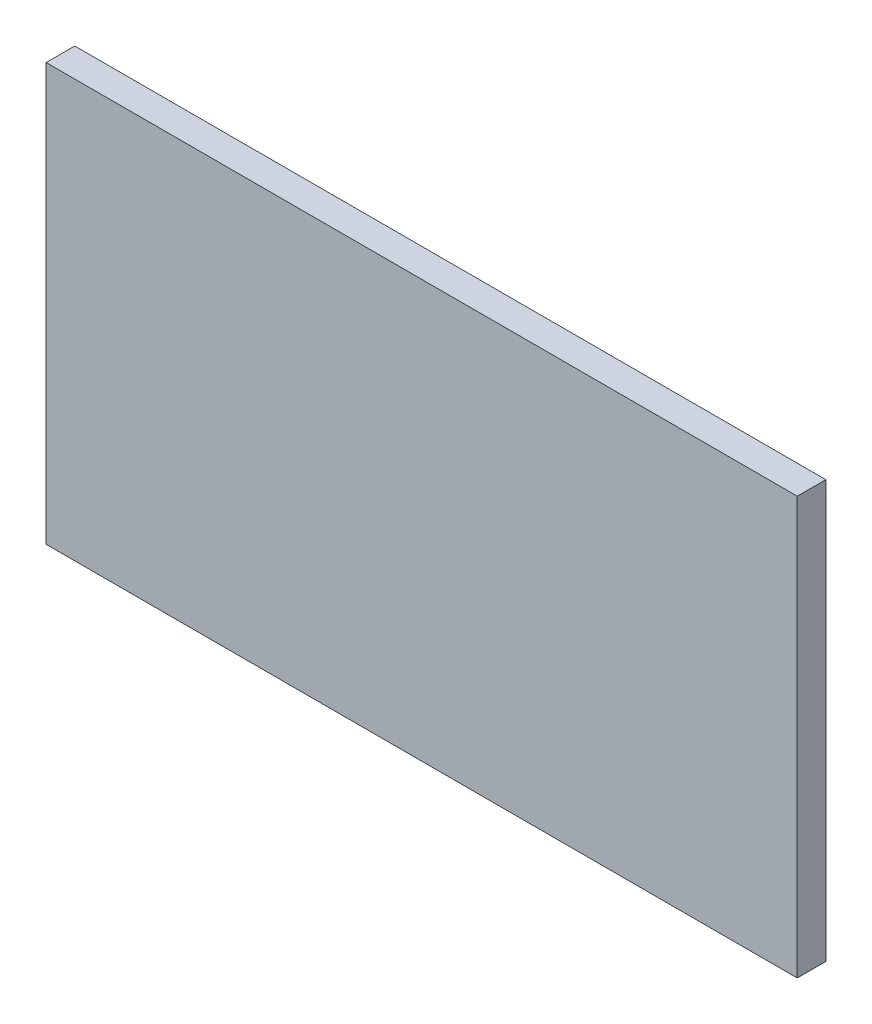
ISO-10303-21;
HEADER;
FILE_DESCRIPTION(('STEP AP214'),'2;1');
FILE_NAME('part.step','',(''),(''),'','','');
FILE_SCHEMA(('AUTOMOTIVE_DESIGN { 1 0 10303 214 1 1 1 1 }'));
ENDSEC;
DATA;
#1=APPLICATION_CONTEXT('core data for automotive mechanical design processes');
#2=APPLICATION_PROTOCOL_DEFINITION('international standard','automotive_design',2000,#1);
#3=PRODUCT_CONTEXT('',#1,'mechanical');
#4=PRODUCT('Part','Part','',(#3));
#5=PRODUCT_RELATED_PRODUCT_CATEGORY('part','',(#4));
#6=PRODUCT_DEFINITION_FORMATION('','',#4);
#7=PRODUCT_DEFINITION_CONTEXT('part definition',#1,'design');
#8=PRODUCT_DEFINITION('design','',#6,#7);
#9=PRODUCT_DEFINITION_SHAPE('','',#8);
#10=(LENGTH_UNIT() NAMED_UNIT(*) SI_UNIT(.MILLI.,.METRE.));
#11=(NAMED_UNIT(*) PLANE_ANGLE_UNIT() SI_UNIT($,.RADIAN.));
#12=(NAMED_UNIT(*) SI_UNIT($,.STERADIAN.) SOLID_ANGLE_UNIT());
#13=UNCERTAINTY_MEASURE_WITH_UNIT(LENGTH_MEASURE(1.E-05),#10,'distance_accuracy_value','');
#14=(GEOMETRIC_REPRESENTATION_CONTEXT(3) GLOBAL_UNCERTAINTY_ASSIGNED_CONTEXT((#13)) GLOBAL_UNIT_ASSIGNED_CONTEXT((#10,
#11,#12)) REPRESENTATION_CONTEXT('',''));
#15=CARTESIAN_POINT('',(0.,0.,0.));
#16=DIRECTION('',(0.,0.,1.));
#17=DIRECTION('',(1.,0.,0.));
#18=AXIS2_PLACEMENT_3D('',#15,#16,#17);
#19=CARTESIAN_POINT('',(0.70008,3.2,0.));
#20=DIRECTION('',(0.,0.,-1.));
#21=DIRECTION('',(-1.,0.,0.));
#22=AXIS2_PLACEMENT_3D('',#19,#20,#21);
#23=PLANE('',#22);
#24=DIRECTION('',(1.,0.,0.));
#25=VECTOR('',#24,1.);
#26=CARTESIAN_POINT('',(0.25008,3.45,0.));
#27=LINE('',#26,#25);
#28=CARTESIAN_POINT('',(0.25008,3.45,0.));
#29=VERTEX_POINT('',#28);
#30=CARTESIAN_POINT('',(1.15008,3.45,0.));
#31=VERTEX_POINT('',#30);
#32=EDGE_CURVE('E55',#29,#31,#27,.T.);
#33=ORIENTED_EDGE('',*,*,#32,.T.);
#34=DIRECTION('',(0.,1.,0.));
#35=VECTOR('',#34,1.);
#36=CARTESIAN_POINT('',(1.15008,3.45,0.));
#37=LINE('',#36,#35);
#38=CARTESIAN_POINT('',(1.15008,2.95,0.));
#39=VERTEX_POINT('',#38);
#40=EDGE_CURVE('E57',#31,#39,#37,.F.);
#41=ORIENTED_EDGE('',*,*,#40,.T.);
#42=DIRECTION('',(1.,0.,0.));
#43=VECTOR('',#42,1.);
#44=CARTESIAN_POINT('',(1.15008,2.95,0.));
#45=LINE('',#44,#43);
#46=CARTESIAN_POINT('',(0.25008,2.95,0.));
#47=VERTEX_POINT('',#46);
#48=EDGE_CURVE('E20',#39,#47,#45,.F.);
#49=ORIENTED_EDGE('',*,*,#48,.T.);
#50=DIRECTION('',(0.,1.,0.));
#51=VECTOR('',#50,1.);
#52=CARTESIAN_POINT('',(0.25008,2.95,0.));
#53=LINE('',#52,#51);
#54=EDGE_CURVE('E80',#47,#29,#53,.T.);
#55=ORIENTED_EDGE('',*,*,#54,.T.);
#56=EDGE_LOOP('',(#33,#41,#49,#55));
#57=FACE_BOUND('',#56,.T.);
#58=ADVANCED_FACE('F17',(#57),#23,.T.);
#59=CARTESIAN_POINT('',(1.15008,2.95,0.));
#60=DIRECTION('',(0.,1.,0.));
#61=DIRECTION('',(0.,0.,1.));
#62=AXIS2_PLACEMENT_3D('',#59,#60,#61);
#63=PLANE('',#62);
#64=DIRECTION('',(0.,0.,-1.));
#65=VECTOR('',#64,1.);
#66=CARTESIAN_POINT('',(0.25008,2.95,0.));
#67=LINE('',#66,#65);
#68=CARTESIAN_POINT('',(0.25008,2.95,0.03429));
#69=VERTEX_POINT('',#68);
#70=EDGE_CURVE('E68',#69,#47,#67,.T.);
#71=ORIENTED_EDGE('',*,*,#70,.T.);
#72=ORIENTED_EDGE('',*,*,#48,.F.);
#73=DIRECTION('',(0.,0.,1.));
#74=VECTOR('',#73,1.);
#75=CARTESIAN_POINT('',(1.15008,2.95,0.));
#76=LINE('',#75,#74);
#77=CARTESIAN_POINT('',(1.15008,2.95,0.03429));
#78=VERTEX_POINT('',#77);
#79=EDGE_CURVE('E63',#39,#78,#76,.T.);
#80=ORIENTED_EDGE('',*,*,#79,.T.);
#81=DIRECTION('',(1.,0.,0.));
#82=VECTOR('',#81,1.);
#83=CARTESIAN_POINT('',(0.70008,2.95,0.03429));
#84=LINE('',#83,#82);
#85=EDGE_CURVE('E83',#69,#78,#84,.T.);
#86=ORIENTED_EDGE('',*,*,#85,.F.);
#87=EDGE_LOOP('',(#71,#72,#80,#86));
#88=FACE_BOUND('',#87,.T.);
#89=ADVANCED_FACE('F65',(#88),#63,.F.);
#90=CARTESIAN_POINT('',(1.15008,3.45,0.));
#91=DIRECTION('',(-1.,0.,0.));
#92=DIRECTION('',(0.,0.,1.));
#93=AXIS2_PLACEMENT_3D('',#90,#91,#92);
#94=PLANE('',#93);
#95=ORIENTED_EDGE('',*,*,#79,.F.);
#96=ORIENTED_EDGE('',*,*,#40,.F.);
#97=DIRECTION('',(0.,0.,-1.));
#98=VECTOR('',#97,1.);
#99=CARTESIAN_POINT('',(1.15008,3.45,0.));
#100=LINE('',#99,#98);
#101=CARTESIAN_POINT('',(1.15008,3.45,0.03429));
#102=VERTEX_POINT('',#101);
#103=EDGE_CURVE('E75',#31,#102,#100,.F.);
#104=ORIENTED_EDGE('',*,*,#103,.T.);
#105=DIRECTION('',(0.,1.,0.));
#106=VECTOR('',#105,1.);
#107=CARTESIAN_POINT('',(1.15008,3.2,0.03429));
#108=LINE('',#107,#106);
#109=EDGE_CURVE('E72',#78,#102,#108,.T.);
#110=ORIENTED_EDGE('',*,*,#109,.F.);
#111=EDGE_LOOP('',(#95,#96,#104,#110));
#112=FACE_BOUND('',#111,.T.);
#113=ADVANCED_FACE('F70',(#112),#94,.F.);
#114=CARTESIAN_POINT('',(0.25008,3.45,0.));
#115=DIRECTION('',(0.,-1.,0.));
#116=DIRECTION('',(0.,0.,-1.));
#117=AXIS2_PLACEMENT_3D('',#114,#115,#116);
#118=PLANE('',#117);
#119=ORIENTED_EDGE('',*,*,#103,.F.);
#120=ORIENTED_EDGE('',*,*,#32,.F.);
#121=DIRECTION('',(0.,0.,-1.));
#122=VECTOR('',#121,1.);
#123=CARTESIAN_POINT('',(0.25008,3.45,0.));
#124=LINE('',#123,#122);
#125=CARTESIAN_POINT('',(0.25008,3.45,0.03429));
#126=VERTEX_POINT('',#125);
#127=EDGE_CURVE('E35',#29,#126,#124,.F.);
#128=ORIENTED_EDGE('',*,*,#127,.T.);
#129=DIRECTION('',(1.,0.,0.));
#130=VECTOR('',#129,1.);
#131=CARTESIAN_POINT('',(0.70008,3.45,0.03429));
#132=LINE('',#131,#130);
#133=EDGE_CURVE('E26',#102,#126,#132,.F.);
#134=ORIENTED_EDGE('',*,*,#133,.F.);
#135=EDGE_LOOP('',(#119,#120,#128,#134));
#136=FACE_BOUND('',#135,.T.);
#137=ADVANCED_FACE('F89',(#136),#118,.F.);
#138=CARTESIAN_POINT('',(0.25008,2.95,0.));
#139=DIRECTION('',(1.,0.,0.));
#140=DIRECTION('',(0.,0.,-1.));
#141=AXIS2_PLACEMENT_3D('',#138,#139,#140);
#142=PLANE('',#141);
#143=ORIENTED_EDGE('',*,*,#127,.F.);
#144=ORIENTED_EDGE('',*,*,#54,.F.);
#145=ORIENTED_EDGE('',*,*,#70,.F.);
#146=DIRECTION('',(0.,1.,0.));
#147=VECTOR('',#146,1.);
#148=CARTESIAN_POINT('',(0.25008,3.2,0.03429));
#149=LINE('',#148,#147);
#150=EDGE_CURVE('E11',#126,#69,#149,.F.);
#151=ORIENTED_EDGE('',*,*,#150,.F.);
#152=EDGE_LOOP('',(#143,#144,#145,#151));
#153=FACE_BOUND('',#152,.T.);
#154=ADVANCED_FACE('F91',(#153),#142,.F.);
#155=CARTESIAN_POINT('',(0.70008,3.2,0.03429));
#156=DIRECTION('',(0.,0.,1.));
#157=DIRECTION('',(1.,0.,0.));
#158=AXIS2_PLACEMENT_3D('',#155,#156,#157);
#159=PLANE('',#158);
#160=ORIENTED_EDGE('',*,*,#133,.T.);
#161=ORIENTED_EDGE('',*,*,#150,.T.);
#162=ORIENTED_EDGE('',*,*,#85,.T.);
#163=ORIENTED_EDGE('',*,*,#109,.T.);
#164=EDGE_LOOP('',(#160,#161,#162,#163));
#165=FACE_BOUND('',#164,.T.);
#166=ADVANCED_FACE('F88',(#165),#159,.T.);
#167=CLOSED_SHELL('',(#58,#89,#113,#137,#154,#166));
#168=MANIFOLD_SOLID_BREP('B1',#167);
#169=ADVANCED_BREP_SHAPE_REPRESENTATION('',(#18,#168),#14);
#170=SHAPE_DEFINITION_REPRESENTATION(#9,#169);
ENDSEC;
END-ISO-10303-21;
